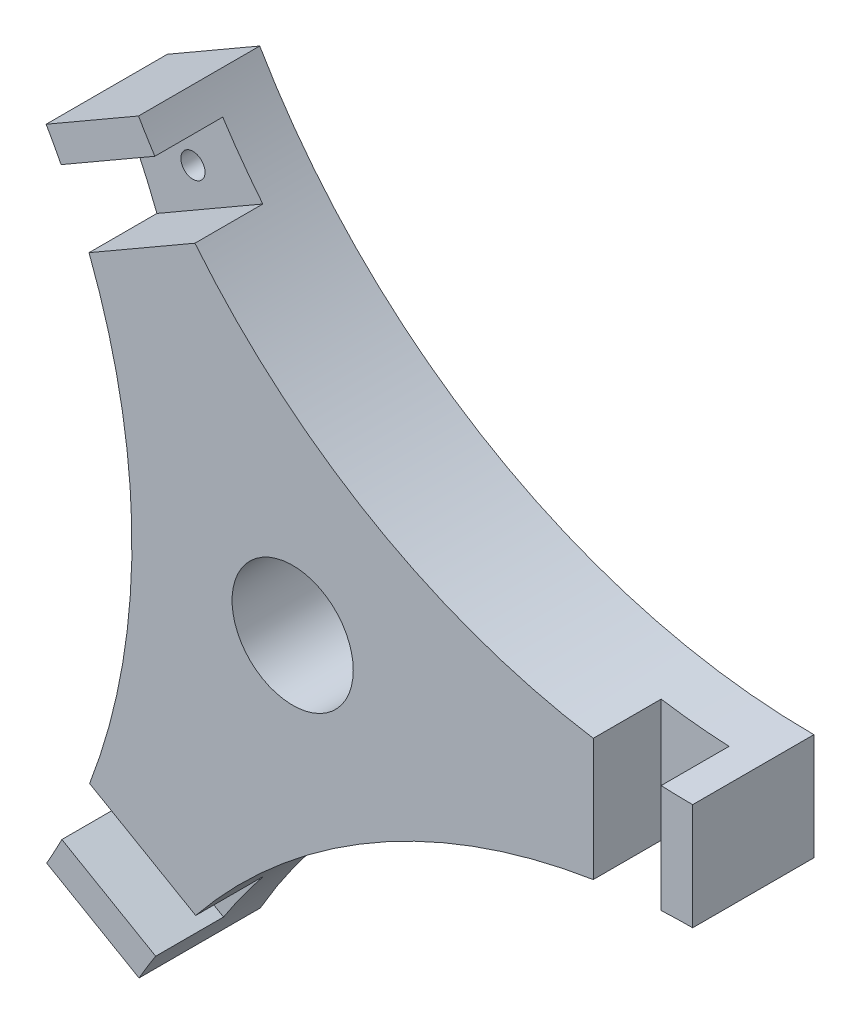
ISO-10303-21;
HEADER;
FILE_DESCRIPTION(('STEP AP214'),'2;1');
FILE_NAME('part.step','',(''),(''),'','','');
FILE_SCHEMA(('AUTOMOTIVE_DESIGN { 1 0 10303 214 1 1 1 1 }'));
ENDSEC;
DATA;
#1=APPLICATION_CONTEXT('core data for automotive mechanical design processes');
#2=APPLICATION_PROTOCOL_DEFINITION('international standard','automotive_design',2000,#1);
#3=PRODUCT_CONTEXT('',#1,'mechanical');
#4=PRODUCT('Part','Part','',(#3));
#5=PRODUCT_RELATED_PRODUCT_CATEGORY('part','',(#4));
#6=PRODUCT_DEFINITION_FORMATION('','',#4);
#7=PRODUCT_DEFINITION_CONTEXT('part definition',#1,'design');
#8=PRODUCT_DEFINITION('design','',#6,#7);
#9=PRODUCT_DEFINITION_SHAPE('','',#8);
#10=(LENGTH_UNIT() NAMED_UNIT(*) SI_UNIT(.MILLI.,.METRE.));
#11=(NAMED_UNIT(*) PLANE_ANGLE_UNIT() SI_UNIT($,.RADIAN.));
#12=(NAMED_UNIT(*) SI_UNIT($,.STERADIAN.) SOLID_ANGLE_UNIT());
#13=UNCERTAINTY_MEASURE_WITH_UNIT(LENGTH_MEASURE(1.E-05),#10,'distance_accuracy_value','');
#14=(GEOMETRIC_REPRESENTATION_CONTEXT(3) GLOBAL_UNCERTAINTY_ASSIGNED_CONTEXT((#13)) GLOBAL_UNIT_ASSIGNED_CONTEXT((#10,
#11,#12)) REPRESENTATION_CONTEXT('',''));
#15=CARTESIAN_POINT('',(0.,0.,0.));
#16=DIRECTION('',(0.,0.,1.));
#17=DIRECTION('',(1.,0.,0.));
#18=AXIS2_PLACEMENT_3D('',#15,#16,#17);
#19=CARTESIAN_POINT('',(41.3639178470361,-71.5532630666437,12.5));
#20=DIRECTION('',(0.,0.,-1.));
#21=DIRECTION('',(-1.,0.,0.));
#22=AXIS2_PLACEMENT_3D('',#19,#20,#21);
#23=PLANE('',#22);
#24=CARTESIAN_POINT('',(0.,0.,12.5));
#25=DIRECTION('',(0.,0.,1.));
#26=DIRECTION('',(1.,0.,0.));
#27=AXIS2_PLACEMENT_3D('',#24,#25,#26);
#28=CIRCLE('',#27,6.25);
#29=CARTESIAN_POINT('',(6.25,0.,12.5));
#30=VERTEX_POINT('',#29);
#31=EDGE_CURVE('E197',#30,#30,#28,.T.);
#32=ORIENTED_EDGE('',*,*,#31,.F.);
#33=EDGE_LOOP('',(#32));
#34=FACE_BOUND('',#33,.T.);
#35=CARTESIAN_POINT('',(41.2500000105281,71.5533612999907,12.5));
#36=DIRECTION('',(0.,0.,-1.));
#37=DIRECTION('',(-1.,0.,0.));
#38=AXIS2_PLACEMENT_3D('',#35,#36,#37);
#39=CIRCLE('',#38,66.0533612999907);
#40=CARTESIAN_POINT('',(31.,6.30013119747944,12.5));
#41=VERTEX_POINT('',#40);
#42=CARTESIAN_POINT('',(-10.0773638707568,29.9775479462477,12.5));
#43=VERTEX_POINT('',#42);
#44=EDGE_CURVE('E175',#41,#43,#39,.T.);
#45=ORIENTED_EDGE('',*,*,#44,.T.);
#46=DIRECTION('',(0.866025403784438,0.500000000000001,0.));
#47=VECTOR('',#46,1.);
#48=CARTESIAN_POINT('',(-23.1397094323187,22.4359992200321,12.5));
#49=LINE('',#48,#47);
#50=CARTESIAN_POINT('',(-20.9990284321859,23.6719219717079,12.5));
#51=VERTEX_POINT('',#50);
#52=EDGE_CURVE('E161',#51,#43,#49,.T.);
#53=ORIENTED_EDGE('',*,*,#52,.F.);
#54=CARTESIAN_POINT('',(-82.6270132225604,-0.0986066236865605,12.5));
#55=DIRECTION('',(0.,0.,-1.));
#56=DIRECTION('',(-1.,0.,0.));
#57=AXIS2_PLACEMENT_3D('',#54,#55,#56);
#58=CIRCLE('',#57,66.0533612999907);
#59=CARTESIAN_POINT('',(-20.9370138922014,-23.7077260830694,12.5));
#60=VERTEX_POINT('',#59);
#61=EDGE_CURVE('E171',#51,#60,#58,.T.);
#62=ORIENTED_EDGE('',*,*,#61,.T.);
#63=DIRECTION('',(-0.866025403784439,0.5,0.));
#64=VECTOR('',#63,1.);
#65=CARTESIAN_POINT('',(-7.86029056767802,-31.2575758146012,12.5));
#66=LINE('',#65,#64);
#67=CARTESIAN_POINT('',(-9.99977731913849,-30.0223425627179,12.5));
#68=VERTEX_POINT('',#67);
#69=EDGE_CURVE('E426',#68,#60,#66,.T.);
#70=ORIENTED_EDGE('',*,*,#69,.F.);
#71=CARTESIAN_POINT('',(41.3639178470361,-71.5532630666437,12.5));
#72=DIRECTION('',(0.,0.,-1.));
#73=DIRECTION('',(-1.,0.,0.));
#74=AXIS2_PLACEMENT_3D('',#71,#72,#73);
#75=CIRCLE('',#74,66.0533612999907);
#76=CARTESIAN_POINT('',(31.,-6.31802913675734,12.5));
#77=VERTEX_POINT('',#76);
#78=EDGE_CURVE('E287',#68,#77,#75,.T.);
#79=ORIENTED_EDGE('',*,*,#78,.T.);
#80=DIRECTION('',(0.,-1.,0.));
#81=VECTOR('',#80,1.);
#82=CARTESIAN_POINT('',(31.,8.82157659455742,12.5));
#83=LINE('',#82,#81);
#84=EDGE_CURVE('E313',#41,#77,#83,.T.);
#85=ORIENTED_EDGE('',*,*,#84,.F.);
#86=EDGE_LOOP('',(#45,#53,#62,#70,#79,#85));
#87=FACE_BOUND('',#86,.T.);
#88=ADVANCED_FACE('F35',(#34,#87),#23,.F.);
#89=CARTESIAN_POINT('',(-17.2849846053381,29.8324025416462,12.5));
#90=DIRECTION('',(0.,0.,-1.));
#91=DIRECTION('',(-1.,0.,0.));
#92=AXIS2_PLACEMENT_3D('',#89,#90,#91);
#93=CYLINDRICAL_SURFACE('',#92,1.25000000000023);
#94=CARTESIAN_POINT('',(-17.2849846053381,29.8324025416462,0.));
#95=DIRECTION('',(0.,0.,1.));
#96=DIRECTION('',(1.,0.,0.));
#97=AXIS2_PLACEMENT_3D('',#94,#95,#96);
#98=CIRCLE('',#97,1.25000000000023);
#99=CARTESIAN_POINT('',(-16.0349846053379,29.8324025416462,0.));
#100=VERTEX_POINT('',#99);
#101=EDGE_CURVE('E329',#100,#100,#98,.T.);
#102=ORIENTED_EDGE('',*,*,#101,.F.);
#103=EDGE_LOOP('',(#102));
#104=FACE_BOUND('',#103,.T.);
#105=CARTESIAN_POINT('',(-17.2849846053381,29.8324025416462,5.5));
#106=DIRECTION('',(0.,0.,1.));
#107=DIRECTION('',(1.,0.,0.));
#108=AXIS2_PLACEMENT_3D('',#105,#106,#107);
#109=CIRCLE('',#108,1.25000000000023);
#110=CARTESIAN_POINT('',(-16.0349846053379,29.8324025416462,5.5));
#111=VERTEX_POINT('',#110);
#112=EDGE_CURVE('E245',#111,#111,#109,.T.);
#113=ORIENTED_EDGE('',*,*,#112,.T.);
#114=EDGE_LOOP('',(#113));
#115=FACE_BOUND('',#114,.T.);
#116=ADVANCED_FACE('F359',(#104,#115),#93,.F.);
#117=CARTESIAN_POINT('',(-25.4231243261525,32.9280740171912,12.5));
#118=VERTEX_POINT('',#117);
#119=CARTESIAN_POINT('',(-23.8774226609054,30.0929840575776,12.5));
#120=VERTEX_POINT('',#119);
#121=EDGE_CURVE('E182',#118,#120,#58,.T.);
#122=ORIENTED_EDGE('',*,*,#121,.T.);
#123=DIRECTION('',(-0.866025403784438,-0.5,0.));
#124=VECTOR('',#123,1.);
#125=CARTESIAN_POINT('',(-26.6397094323187,28.4981770465231,12.5));
#126=LINE('',#125,#124);
#127=CARTESIAN_POINT('',(-14.2096082791269,35.6746992933727,12.5));
#128=VERTEX_POINT('',#127);
#129=EDGE_CURVE('E176',#128,#120,#126,.T.);
#130=ORIENTED_EDGE('',*,*,#129,.F.);
#131=CARTESIAN_POINT('',(-15.8968448845237,38.4280740171912,12.5));
#132=VERTEX_POINT('',#131);
#133=EDGE_CURVE('E257',#128,#132,#39,.T.);
#134=ORIENTED_EDGE('',*,*,#133,.T.);
#135=DIRECTION('',(-0.866025403784438,-0.500000000000001,0.));
#136=VECTOR('',#135,1.);
#137=CARTESIAN_POINT('',(-15.8968448845237,38.4280740171912,12.5));
#138=LINE('',#137,#136);
#139=EDGE_CURVE('E187',#132,#118,#138,.T.);
#140=ORIENTED_EDGE('',*,*,#139,.T.);
#141=EDGE_LOOP('',(#122,#130,#134,#140));
#142=FACE_BOUND('',#141,.T.);
#143=ADVANCED_FACE('F253',(#142),#23,.F.);
#144=CARTESIAN_POINT('',(-17.2281107596581,-29.9309109319857,12.5));
#145=DIRECTION('',(0.,0.,-1.));
#146=DIRECTION('',(-1.,0.,0.));
#147=AXIS2_PLACEMENT_3D('',#144,#145,#146);
#148=CYLINDRICAL_SURFACE('',#147,1.25);
#149=CARTESIAN_POINT('',(-17.2281107596581,-29.9309109319857,0.));
#150=DIRECTION('',(0.,0.,1.));
#151=DIRECTION('',(1.,0.,0.));
#152=AXIS2_PLACEMENT_3D('',#149,#150,#151);
#153=CIRCLE('',#152,1.25);
#154=CARTESIAN_POINT('',(-15.9781107596581,-29.9309109319857,0.));
#155=VERTEX_POINT('',#154);
#156=EDGE_CURVE('E332',#155,#155,#153,.T.);
#157=ORIENTED_EDGE('',*,*,#156,.F.);
#158=EDGE_LOOP('',(#157));
#159=FACE_BOUND('',#158,.T.);
#160=CARTESIAN_POINT('',(-17.2281107596581,-29.9309109319857,5.5));
#161=DIRECTION('',(0.,0.,1.));
#162=DIRECTION('',(1.,0.,0.));
#163=AXIS2_PLACEMENT_3D('',#160,#161,#162);
#164=CIRCLE('',#163,1.25);
#165=CARTESIAN_POINT('',(-15.9781107596581,-29.9309109319857,5.5));
#166=VERTEX_POINT('',#165);
#167=EDGE_CURVE('E237',#166,#166,#164,.T.);
#168=ORIENTED_EDGE('',*,*,#167,.T.);
#169=EDGE_LOOP('',(#168));
#170=FACE_BOUND('',#169,.T.);
#171=ADVANCED_FACE('F369',(#159,#170),#148,.F.);
#172=CARTESIAN_POINT('',(-15.8399710388437,-38.5265824075307,12.5));
#173=VERTEX_POINT('',#172);
#174=CARTESIAN_POINT('',(-14.1266937457081,-35.7225700215696,12.5));
#175=VERTEX_POINT('',#174);
#176=EDGE_CURVE('E281',#173,#175,#75,.T.);
#177=ORIENTED_EDGE('',*,*,#176,.T.);
#178=DIRECTION('',(0.866025403784439,-0.5,0.));
#179=VECTOR('',#178,1.);
#180=CARTESIAN_POINT('',(-11.360290567678,-37.3197536410923,12.5));
#181=LINE('',#180,#179);
#182=CARTESIAN_POINT('',(-23.7994559463766,-30.1379981612064,12.5));
#183=VERTEX_POINT('',#182);
#184=EDGE_CURVE('E431',#183,#175,#181,.T.);
#185=ORIENTED_EDGE('',*,*,#184,.F.);
#186=CARTESIAN_POINT('',(-25.3662504804725,-33.0265824075307,12.5));
#187=VERTEX_POINT('',#186);
#188=EDGE_CURVE('E183',#183,#187,#58,.T.);
#189=ORIENTED_EDGE('',*,*,#188,.T.);
#190=DIRECTION('',(0.866025403784439,-0.5,0.));
#191=VECTOR('',#190,1.);
#192=CARTESIAN_POINT('',(-25.3662504804725,-33.0265824075307,12.5));
#193=LINE('',#192,#191);
#194=EDGE_CURVE('E186',#187,#173,#193,.T.);
#195=ORIENTED_EDGE('',*,*,#194,.T.);
#196=EDGE_LOOP('',(#177,#185,#189,#195));
#197=FACE_BOUND('',#196,.T.);
#198=ADVANCED_FACE('F370',(#197),#23,.F.);
#199=CARTESIAN_POINT('',(34.5,0.,12.5));
#200=DIRECTION('',(0.,0.,-1.));
#201=DIRECTION('',(-1.,0.,0.));
#202=AXIS2_PLACEMENT_3D('',#199,#200,#201);
#203=CYLINDRICAL_SURFACE('',#202,1.25);
#204=CARTESIAN_POINT('',(34.5,0.,0.));
#205=DIRECTION('',(0.,0.,1.));
#206=DIRECTION('',(1.,0.,0.));
#207=AXIS2_PLACEMENT_3D('',#204,#205,#206);
#208=CIRCLE('',#207,1.25);
#209=CARTESIAN_POINT('',(35.75,0.,0.));
#210=VERTEX_POINT('',#209);
#211=EDGE_CURVE('E335',#210,#210,#208,.T.);
#212=ORIENTED_EDGE('',*,*,#211,.F.);
#213=EDGE_LOOP('',(#212));
#214=FACE_BOUND('',#213,.T.);
#215=CARTESIAN_POINT('',(34.5,0.,5.5));
#216=DIRECTION('',(0.,0.,1.));
#217=DIRECTION('',(1.,0.,0.));
#218=AXIS2_PLACEMENT_3D('',#215,#216,#217);
#219=CIRCLE('',#218,1.25);
#220=CARTESIAN_POINT('',(35.75,0.,5.5));
#221=VERTEX_POINT('',#220);
#222=EDGE_CURVE('E226',#221,#221,#219,.T.);
#223=ORIENTED_EDGE('',*,*,#222,.T.);
#224=EDGE_LOOP('',(#223));
#225=FACE_BOUND('',#224,.T.);
#226=ADVANCED_FACE('F372',(#214,#225),#203,.F.);
#227=CARTESIAN_POINT('',(41.25,5.5,12.5));
#228=VERTEX_POINT('',#227);
#229=CARTESIAN_POINT('',(38.,5.58000274550542,12.5));
#230=VERTEX_POINT('',#229);
#231=EDGE_CURVE('E260',#228,#230,#39,.T.);
#232=ORIENTED_EDGE('',*,*,#231,.T.);
#233=DIRECTION('',(0.,1.,0.));
#234=VECTOR('',#233,1.);
#235=CARTESIAN_POINT('',(38.,8.82157659455742,12.5));
#236=LINE('',#235,#234);
#237=CARTESIAN_POINT('',(38.,-5.58561496740113,12.5));
#238=VERTEX_POINT('',#237);
#239=EDGE_CURVE('E298',#238,#230,#236,.T.);
#240=ORIENTED_EDGE('',*,*,#239,.F.);
#241=CARTESIAN_POINT('',(41.25,-5.5,12.5));
#242=VERTEX_POINT('',#241);
#243=EDGE_CURVE('E207',#238,#242,#75,.T.);
#244=ORIENTED_EDGE('',*,*,#243,.T.);
#245=DIRECTION('',(0.,1.,0.));
#246=VECTOR('',#245,1.);
#247=CARTESIAN_POINT('',(41.25,-5.5,12.5));
#248=LINE('',#247,#246);
#249=EDGE_CURVE('E286',#242,#228,#248,.T.);
#250=ORIENTED_EDGE('',*,*,#249,.T.);
#251=EDGE_LOOP('',(#232,#240,#244,#250));
#252=FACE_BOUND('',#251,.T.);
#253=ADVANCED_FACE('F296',(#252),#23,.F.);
#254=CARTESIAN_POINT('',(41.3639178470361,-71.5532630666437,0.));
#255=DIRECTION('',(0.,0.,-1.));
#256=DIRECTION('',(-1.,0.,0.));
#257=AXIS2_PLACEMENT_3D('',#254,#255,#256);
#258=PLANE('',#257);
#259=ORIENTED_EDGE('',*,*,#156,.T.);
#260=EDGE_LOOP('',(#259));
#261=FACE_BOUND('',#260,.T.);
#262=CARTESIAN_POINT('',(0.,0.,0.));
#263=DIRECTION('',(0.,0.,1.));
#264=DIRECTION('',(1.,0.,0.));
#265=AXIS2_PLACEMENT_3D('',#262,#263,#264);
#266=CIRCLE('',#265,6.25);
#267=CARTESIAN_POINT('',(6.25,0.,0.));
#268=VERTEX_POINT('',#267);
#269=EDGE_CURVE('E338',#268,#268,#266,.T.);
#270=ORIENTED_EDGE('',*,*,#269,.T.);
#271=EDGE_LOOP('',(#270));
#272=FACE_BOUND('',#271,.T.);
#273=CARTESIAN_POINT('',(41.3639178470361,-71.5532630666437,0.));
#274=DIRECTION('',(0.,0.,-1.));
#275=DIRECTION('',(-1.,0.,0.));
#276=AXIS2_PLACEMENT_3D('',#273,#274,#275);
#277=CIRCLE('',#276,66.0533612999907);
#278=CARTESIAN_POINT('',(-15.8399710388437,-38.5265824075307,0.));
#279=VERTEX_POINT('',#278);
#280=CARTESIAN_POINT('',(41.25,-5.5,0.));
#281=VERTEX_POINT('',#280);
#282=EDGE_CURVE('E193',#279,#281,#277,.T.);
#283=ORIENTED_EDGE('',*,*,#282,.F.);
#284=DIRECTION('',(0.866025403784439,-0.5,0.));
#285=VECTOR('',#284,1.);
#286=CARTESIAN_POINT('',(-25.3662504804725,-33.0265824075307,0.));
#287=LINE('',#286,#285);
#288=CARTESIAN_POINT('',(-25.3662504804725,-33.0265824075307,0.));
#289=VERTEX_POINT('',#288);
#290=EDGE_CURVE('E205',#289,#279,#287,.T.);
#291=ORIENTED_EDGE('',*,*,#290,.F.);
#292=CARTESIAN_POINT('',(-82.6270132225604,-0.0986066236865605,0.));
#293=DIRECTION('',(0.,0.,-1.));
#294=DIRECTION('',(-1.,0.,0.));
#295=AXIS2_PLACEMENT_3D('',#292,#293,#294);
#296=CIRCLE('',#295,66.0533612999907);
#297=CARTESIAN_POINT('',(-25.4231243261525,32.9280740171912,0.));
#298=VERTEX_POINT('',#297);
#299=EDGE_CURVE('E203',#298,#289,#296,.T.);
#300=ORIENTED_EDGE('',*,*,#299,.F.);
#301=DIRECTION('',(-0.866025403784438,-0.500000000000001,0.));
#302=VECTOR('',#301,1.);
#303=CARTESIAN_POINT('',(-15.8968448845237,38.4280740171912,0.));
#304=LINE('',#303,#302);
#305=CARTESIAN_POINT('',(-15.8968448845237,38.4280740171912,0.));
#306=VERTEX_POINT('',#305);
#307=EDGE_CURVE('E201',#306,#298,#304,.T.);
#308=ORIENTED_EDGE('',*,*,#307,.F.);
#309=CARTESIAN_POINT('',(41.2500000105281,71.5533612999907,0.));
#310=DIRECTION('',(0.,0.,-1.));
#311=DIRECTION('',(-1.,0.,0.));
#312=AXIS2_PLACEMENT_3D('',#309,#310,#311);
#313=CIRCLE('',#312,66.0533612999907);
#314=CARTESIAN_POINT('',(41.25,5.5,0.));
#315=VERTEX_POINT('',#314);
#316=EDGE_CURVE('E199',#315,#306,#313,.T.);
#317=ORIENTED_EDGE('',*,*,#316,.F.);
#318=DIRECTION('',(0.,1.,0.));
#319=VECTOR('',#318,1.);
#320=CARTESIAN_POINT('',(41.25,-5.5,0.));
#321=LINE('',#320,#319);
#322=EDGE_CURVE('E196',#281,#315,#321,.T.);
#323=ORIENTED_EDGE('',*,*,#322,.F.);
#324=EDGE_LOOP('',(#283,#291,#300,#308,#317,#323));
#325=FACE_BOUND('',#324,.T.);
#326=ORIENTED_EDGE('',*,*,#211,.T.);
#327=EDGE_LOOP('',(#326));
#328=FACE_BOUND('',#327,.T.);
#329=ORIENTED_EDGE('',*,*,#101,.T.);
#330=EDGE_LOOP('',(#329));
#331=FACE_BOUND('',#330,.T.);
#332=ADVANCED_FACE('F268',(#261,#272,#325,#328,#331),#258,.T.);
#333=CARTESIAN_POINT('',(41.3639178470361,-71.5532630666437,12.5));
#334=DIRECTION('',(0.,0.,-1.));
#335=DIRECTION('',(-1.,0.,0.));
#336=AXIS2_PLACEMENT_3D('',#333,#334,#335);
#337=CYLINDRICAL_SURFACE('',#336,66.0533612999907);
#338=ORIENTED_EDGE('',*,*,#78,.F.);
#339=DIRECTION('',(0.,0.,-1.));
#340=VECTOR('',#339,1.);
#341=CARTESIAN_POINT('',(-9.99977731913849,-30.0223425627179,12.5));
#342=LINE('',#341,#340);
#343=CARTESIAN_POINT('',(-9.99977731913849,-30.0223425627179,5.5));
#344=VERTEX_POINT('',#343);
#345=EDGE_CURVE('E318',#68,#344,#342,.T.);
#346=ORIENTED_EDGE('',*,*,#345,.T.);
#347=CARTESIAN_POINT('',(41.3639178470361,-71.5532630666437,5.5));
#348=DIRECTION('',(0.,0.,1.));
#349=DIRECTION('',(1.,0.,0.));
#350=AXIS2_PLACEMENT_3D('',#347,#348,#349);
#351=CIRCLE('',#350,66.0533612999907);
#352=CARTESIAN_POINT('',(-14.1266937457081,-35.7225700215696,5.5));
#353=VERTEX_POINT('',#352);
#354=EDGE_CURVE('E437',#353,#344,#351,.F.);
#355=ORIENTED_EDGE('',*,*,#354,.F.);
#356=DIRECTION('',(0.,0.,-1.));
#357=VECTOR('',#356,1.);
#358=CARTESIAN_POINT('',(-14.1266937457081,-35.7225700215696,12.5));
#359=LINE('',#358,#357);
#360=EDGE_CURVE('E283',#353,#175,#359,.F.);
#361=ORIENTED_EDGE('',*,*,#360,.T.);
#362=ORIENTED_EDGE('',*,*,#176,.F.);
#363=DIRECTION('',(0.,0.,-1.));
#364=VECTOR('',#363,1.);
#365=CARTESIAN_POINT('',(-15.8399710388437,-38.5265824075307,12.5));
#366=LINE('',#365,#364);
#367=EDGE_CURVE('E192',#173,#279,#366,.T.);
#368=ORIENTED_EDGE('',*,*,#367,.T.);
#369=ORIENTED_EDGE('',*,*,#282,.T.);
#370=DIRECTION('',(0.,0.,-1.));
#371=VECTOR('',#370,1.);
#372=CARTESIAN_POINT('',(41.25,-5.5,12.5));
#373=LINE('',#372,#371);
#374=EDGE_CURVE('E222',#242,#281,#373,.T.);
#375=ORIENTED_EDGE('',*,*,#374,.F.);
#376=ORIENTED_EDGE('',*,*,#243,.F.);
#377=DIRECTION('',(0.,0.,-1.));
#378=VECTOR('',#377,1.);
#379=CARTESIAN_POINT('',(38.,-5.58561496740113,12.5));
#380=LINE('',#379,#378);
#381=CARTESIAN_POINT('',(38.,-5.58561496740113,5.5));
#382=VERTEX_POINT('',#381);
#383=EDGE_CURVE('E311',#238,#382,#380,.T.);
#384=ORIENTED_EDGE('',*,*,#383,.T.);
#385=CARTESIAN_POINT('',(41.3639178470361,-71.5532630666437,5.5));
#386=DIRECTION('',(0.,0.,1.));
#387=DIRECTION('',(1.,0.,0.));
#388=AXIS2_PLACEMENT_3D('',#385,#386,#387);
#389=CIRCLE('',#388,66.0533612999907);
#390=CARTESIAN_POINT('',(31.,-6.31802913675734,5.5));
#391=VERTEX_POINT('',#390);
#392=EDGE_CURVE('E323',#391,#382,#389,.F.);
#393=ORIENTED_EDGE('',*,*,#392,.F.);
#394=DIRECTION('',(0.,0.,-1.));
#395=VECTOR('',#394,1.);
#396=CARTESIAN_POINT('',(31.,-6.31802913675734,12.5));
#397=LINE('',#396,#395);
#398=EDGE_CURVE('E326',#391,#77,#397,.F.);
#399=ORIENTED_EDGE('',*,*,#398,.T.);
#400=EDGE_LOOP('',(#338,#346,#355,#361,#362,#368,#369,#375,#376,#384,#393,#399));
#401=FACE_BOUND('',#400,.T.);
#402=ADVANCED_FACE('F37',(#401),#337,.F.);
#403=CARTESIAN_POINT('',(41.25,-5.5,12.5));
#404=DIRECTION('',(-1.,0.,0.));
#405=DIRECTION('',(0.,0.,1.));
#406=AXIS2_PLACEMENT_3D('',#403,#404,#405);
#407=PLANE('',#406);
#408=ORIENTED_EDGE('',*,*,#322,.T.);
#409=DIRECTION('',(0.,0.,-1.));
#410=VECTOR('',#409,1.);
#411=CARTESIAN_POINT('',(41.25,5.5,12.5));
#412=LINE('',#411,#410);
#413=EDGE_CURVE('E219',#228,#315,#412,.T.);
#414=ORIENTED_EDGE('',*,*,#413,.F.);
#415=ORIENTED_EDGE('',*,*,#249,.F.);
#416=ORIENTED_EDGE('',*,*,#374,.T.);
#417=EDGE_LOOP('',(#408,#414,#415,#416));
#418=FACE_BOUND('',#417,.T.);
#419=ADVANCED_FACE('F301',(#418),#407,.F.);
#420=CARTESIAN_POINT('',(41.2500000105281,71.5533612999907,12.5));
#421=DIRECTION('',(0.,0.,-1.));
#422=DIRECTION('',(-1.,0.,0.));
#423=AXIS2_PLACEMENT_3D('',#420,#421,#422);
#424=CYLINDRICAL_SURFACE('',#423,66.0533612999907);
#425=CARTESIAN_POINT('',(41.2500000105281,71.5533612999907,5.5));
#426=DIRECTION('',(0.,0.,1.));
#427=DIRECTION('',(1.,0.,0.));
#428=AXIS2_PLACEMENT_3D('',#425,#426,#427);
#429=CIRCLE('',#428,66.0533612999907);
#430=CARTESIAN_POINT('',(-10.0773638707568,29.9775479462477,5.5));
#431=VERTEX_POINT('',#430);
#432=CARTESIAN_POINT('',(-14.2096082791269,35.6746992933727,5.5));
#433=VERTEX_POINT('',#432);
#434=EDGE_CURVE('E419',#431,#433,#429,.F.);
#435=ORIENTED_EDGE('',*,*,#434,.F.);
#436=DIRECTION('',(0.,0.,-1.));
#437=VECTOR('',#436,1.);
#438=CARTESIAN_POINT('',(-10.0773638707568,29.9775479462477,12.5));
#439=LINE('',#438,#437);
#440=EDGE_CURVE('E424',#431,#43,#439,.F.);
#441=ORIENTED_EDGE('',*,*,#440,.T.);
#442=ORIENTED_EDGE('',*,*,#44,.F.);
#443=DIRECTION('',(0.,0.,-1.));
#444=VECTOR('',#443,1.);
#445=CARTESIAN_POINT('',(31.,6.30013119747944,12.5));
#446=LINE('',#445,#444);
#447=CARTESIAN_POINT('',(31.,6.30013119747944,5.5));
#448=VERTEX_POINT('',#447);
#449=EDGE_CURVE('E233',#41,#448,#446,.T.);
#450=ORIENTED_EDGE('',*,*,#449,.T.);
#451=CARTESIAN_POINT('',(41.2500000105281,71.5533612999907,5.5));
#452=DIRECTION('',(0.,0.,1.));
#453=DIRECTION('',(1.,0.,0.));
#454=AXIS2_PLACEMENT_3D('',#451,#452,#453);
#455=CIRCLE('',#454,66.0533612999907);
#456=CARTESIAN_POINT('',(38.,5.58000274550542,5.5));
#457=VERTEX_POINT('',#456);
#458=EDGE_CURVE('E229',#457,#448,#455,.F.);
#459=ORIENTED_EDGE('',*,*,#458,.F.);
#460=DIRECTION('',(0.,0.,-1.));
#461=VECTOR('',#460,1.);
#462=CARTESIAN_POINT('',(38.,5.58000274550542,12.5));
#463=LINE('',#462,#461);
#464=EDGE_CURVE('E225',#457,#230,#463,.F.);
#465=ORIENTED_EDGE('',*,*,#464,.T.);
#466=ORIENTED_EDGE('',*,*,#231,.F.);
#467=ORIENTED_EDGE('',*,*,#413,.T.);
#468=ORIENTED_EDGE('',*,*,#316,.T.);
#469=DIRECTION('',(0.,0.,-1.));
#470=VECTOR('',#469,1.);
#471=CARTESIAN_POINT('',(-15.8968448845237,38.4280740171912,12.5));
#472=LINE('',#471,#470);
#473=EDGE_CURVE('E216',#132,#306,#472,.T.);
#474=ORIENTED_EDGE('',*,*,#473,.F.);
#475=ORIENTED_EDGE('',*,*,#133,.F.);
#476=DIRECTION('',(0.,0.,-1.));
#477=VECTOR('',#476,1.);
#478=CARTESIAN_POINT('',(-14.2096082791269,35.6746992933727,12.5));
#479=LINE('',#478,#477);
#480=EDGE_CURVE('E421',#128,#433,#479,.T.);
#481=ORIENTED_EDGE('',*,*,#480,.T.);
#482=EDGE_LOOP('',(#435,#441,#442,#450,#459,#465,#466,#467,#468,#474,#475,#481));
#483=FACE_BOUND('',#482,.T.);
#484=ADVANCED_FACE('F305',(#483),#424,.F.);
#485=CARTESIAN_POINT('',(-15.8968448845237,38.4280740171912,12.5));
#486=DIRECTION('',(0.5,-0.866025403784438,0.));
#487=DIRECTION('',(0.866025403784438,0.5,0.));
#488=AXIS2_PLACEMENT_3D('',#485,#486,#487);
#489=PLANE('',#488);
#490=ORIENTED_EDGE('',*,*,#307,.T.);
#491=DIRECTION('',(0.,0.,-1.));
#492=VECTOR('',#491,1.);
#493=CARTESIAN_POINT('',(-25.4231243261525,32.9280740171912,12.5));
#494=LINE('',#493,#492);
#495=EDGE_CURVE('E213',#118,#298,#494,.T.);
#496=ORIENTED_EDGE('',*,*,#495,.F.);
#497=ORIENTED_EDGE('',*,*,#139,.F.);
#498=ORIENTED_EDGE('',*,*,#473,.T.);
#499=EDGE_LOOP('',(#490,#496,#497,#498));
#500=FACE_BOUND('',#499,.T.);
#501=ADVANCED_FACE('F261',(#500),#489,.F.);
#502=CARTESIAN_POINT('',(-82.6270132225604,-0.0986066236865605,12.5));
#503=DIRECTION('',(0.,0.,-1.));
#504=DIRECTION('',(-1.,0.,0.));
#505=AXIS2_PLACEMENT_3D('',#502,#503,#504);
#506=CYLINDRICAL_SURFACE('',#505,66.0533612999907);
#507=ORIENTED_EDGE('',*,*,#61,.F.);
#508=DIRECTION('',(0.,0.,-1.));
#509=VECTOR('',#508,1.);
#510=CARTESIAN_POINT('',(-20.9990284321859,23.6719219717079,12.5));
#511=LINE('',#510,#509);
#512=CARTESIAN_POINT('',(-20.9990284321859,23.6719219717079,5.5));
#513=VERTEX_POINT('',#512);
#514=EDGE_CURVE('E11',#51,#513,#511,.T.);
#515=ORIENTED_EDGE('',*,*,#514,.T.);
#516=CARTESIAN_POINT('',(-82.6270132225604,-0.0986066236865605,5.5));
#517=DIRECTION('',(0.,0.,1.));
#518=DIRECTION('',(1.,0.,0.));
#519=AXIS2_PLACEMENT_3D('',#516,#517,#518);
#520=CIRCLE('',#519,66.0533612999907);
#521=CARTESIAN_POINT('',(-23.8774226609054,30.0929840575776,5.5));
#522=VERTEX_POINT('',#521);
#523=EDGE_CURVE('E247',#522,#513,#520,.F.);
#524=ORIENTED_EDGE('',*,*,#523,.F.);
#525=DIRECTION('',(0.,0.,-1.));
#526=VECTOR('',#525,1.);
#527=CARTESIAN_POINT('',(-23.8774226609054,30.0929840575776,12.5));
#528=LINE('',#527,#526);
#529=EDGE_CURVE('E43',#522,#120,#528,.F.);
#530=ORIENTED_EDGE('',*,*,#529,.T.);
#531=ORIENTED_EDGE('',*,*,#121,.F.);
#532=ORIENTED_EDGE('',*,*,#495,.T.);
#533=ORIENTED_EDGE('',*,*,#299,.T.);
#534=DIRECTION('',(0.,0.,-1.));
#535=VECTOR('',#534,1.);
#536=CARTESIAN_POINT('',(-25.3662504804725,-33.0265824075307,12.5));
#537=LINE('',#536,#535);
#538=EDGE_CURVE('E210',#187,#289,#537,.T.);
#539=ORIENTED_EDGE('',*,*,#538,.F.);
#540=ORIENTED_EDGE('',*,*,#188,.F.);
#541=DIRECTION('',(0.,0.,-1.));
#542=VECTOR('',#541,1.);
#543=CARTESIAN_POINT('',(-23.7994559463766,-30.1379981612064,12.5));
#544=LINE('',#543,#542);
#545=CARTESIAN_POINT('',(-23.7994559463766,-30.1379981612064,5.5));
#546=VERTEX_POINT('',#545);
#547=EDGE_CURVE('E236',#183,#546,#544,.T.);
#548=ORIENTED_EDGE('',*,*,#547,.T.);
#549=CARTESIAN_POINT('',(-82.6270132225604,-0.0986066236865605,5.5));
#550=DIRECTION('',(0.,0.,1.));
#551=DIRECTION('',(1.,0.,0.));
#552=AXIS2_PLACEMENT_3D('',#549,#550,#551);
#553=CIRCLE('',#552,66.0533612999907);
#554=CARTESIAN_POINT('',(-20.9370138922014,-23.7077260830694,5.5));
#555=VERTEX_POINT('',#554);
#556=EDGE_CURVE('E240',#555,#546,#553,.F.);
#557=ORIENTED_EDGE('',*,*,#556,.F.);
#558=DIRECTION('',(0.,0.,-1.));
#559=VECTOR('',#558,1.);
#560=CARTESIAN_POINT('',(-20.9370138922014,-23.7077260830694,12.5));
#561=LINE('',#560,#559);
#562=EDGE_CURVE('E181',#555,#60,#561,.F.);
#563=ORIENTED_EDGE('',*,*,#562,.T.);
#564=EDGE_LOOP('',(#507,#515,#524,#530,#531,#532,#533,#539,#540,#548,#557,#563));
#565=FACE_BOUND('',#564,.T.);
#566=ADVANCED_FACE('F179',(#565),#506,.F.);
#567=CARTESIAN_POINT('',(-25.3662504804725,-33.0265824075307,12.5));
#568=DIRECTION('',(0.5,0.866025403784439,0.));
#569=DIRECTION('',(-0.866025403784439,0.5,0.));
#570=AXIS2_PLACEMENT_3D('',#567,#568,#569);
#571=PLANE('',#570);
#572=ORIENTED_EDGE('',*,*,#290,.T.);
#573=ORIENTED_EDGE('',*,*,#367,.F.);
#574=ORIENTED_EDGE('',*,*,#194,.F.);
#575=ORIENTED_EDGE('',*,*,#538,.T.);
#576=EDGE_LOOP('',(#572,#573,#574,#575));
#577=FACE_BOUND('',#576,.T.);
#578=ADVANCED_FACE('F273',(#577),#571,.F.);
#579=CARTESIAN_POINT('',(0.,0.,12.5));
#580=DIRECTION('',(0.,0.,-1.));
#581=DIRECTION('',(-1.,0.,0.));
#582=AXIS2_PLACEMENT_3D('',#579,#580,#581);
#583=CYLINDRICAL_SURFACE('',#582,6.25);
#584=ORIENTED_EDGE('',*,*,#31,.T.);
#585=EDGE_LOOP('',(#584));
#586=FACE_BOUND('',#585,.T.);
#587=ORIENTED_EDGE('',*,*,#269,.F.);
#588=EDGE_LOOP('',(#587));
#589=FACE_BOUND('',#588,.T.);
#590=ADVANCED_FACE('F344',(#586,#589),#583,.F.);
#591=CARTESIAN_POINT('',(31.,8.82157659455742,5.5));
#592=DIRECTION('',(-1.,0.,0.));
#593=DIRECTION('',(0.,0.,1.));
#594=AXIS2_PLACEMENT_3D('',#591,#592,#593);
#595=PLANE('',#594);
#596=DIRECTION('',(0.,-1.,0.));
#597=VECTOR('',#596,1.);
#598=CARTESIAN_POINT('',(31.,8.82157659455742,5.5));
#599=LINE('',#598,#597);
#600=EDGE_CURVE('E312',#448,#391,#599,.T.);
#601=ORIENTED_EDGE('',*,*,#600,.F.);
#602=ORIENTED_EDGE('',*,*,#449,.F.);
#603=ORIENTED_EDGE('',*,*,#84,.T.);
#604=ORIENTED_EDGE('',*,*,#398,.F.);
#605=EDGE_LOOP('',(#601,#602,#603,#604));
#606=FACE_BOUND('',#605,.T.);
#607=ADVANCED_FACE('F346',(#606),#595,.F.);
#608=CARTESIAN_POINT('',(38.,8.82157659455742,5.5));
#609=DIRECTION('',(1.,0.,0.));
#610=DIRECTION('',(0.,0.,-1.));
#611=AXIS2_PLACEMENT_3D('',#608,#609,#610);
#612=PLANE('',#611);
#613=ORIENTED_EDGE('',*,*,#239,.T.);
#614=ORIENTED_EDGE('',*,*,#464,.F.);
#615=DIRECTION('',(0.,1.,0.));
#616=VECTOR('',#615,1.);
#617=CARTESIAN_POINT('',(38.,8.82157659455742,5.5));
#618=LINE('',#617,#616);
#619=EDGE_CURVE('E230',#382,#457,#618,.T.);
#620=ORIENTED_EDGE('',*,*,#619,.F.);
#621=ORIENTED_EDGE('',*,*,#383,.F.);
#622=EDGE_LOOP('',(#613,#614,#620,#621));
#623=FACE_BOUND('',#622,.T.);
#624=ADVANCED_FACE('F310',(#623),#612,.F.);
#625=CARTESIAN_POINT('',(0.,0.,5.5));
#626=DIRECTION('',(0.,0.,1.));
#627=DIRECTION('',(1.,0.,0.));
#628=AXIS2_PLACEMENT_3D('',#625,#626,#627);
#629=PLANE('',#628);
#630=ORIENTED_EDGE('',*,*,#222,.F.);
#631=EDGE_LOOP('',(#630));
#632=FACE_BOUND('',#631,.T.);
#633=ORIENTED_EDGE('',*,*,#392,.T.);
#634=ORIENTED_EDGE('',*,*,#619,.T.);
#635=ORIENTED_EDGE('',*,*,#458,.T.);
#636=ORIENTED_EDGE('',*,*,#600,.T.);
#637=EDGE_LOOP('',(#633,#634,#635,#636));
#638=FACE_BOUND('',#637,.T.);
#639=ADVANCED_FACE('F392',(#632,#638),#629,.T.);
#640=CARTESIAN_POINT('',(-7.86029056767802,-31.2575758146012,5.5));
#641=DIRECTION('',(0.5,0.866025403784439,0.));
#642=DIRECTION('',(-0.866025403784439,0.5,0.));
#643=AXIS2_PLACEMENT_3D('',#640,#641,#642);
#644=PLANE('',#643);
#645=ORIENTED_EDGE('',*,*,#69,.T.);
#646=ORIENTED_EDGE('',*,*,#562,.F.);
#647=DIRECTION('',(-0.866025403784439,0.5,0.));
#648=VECTOR('',#647,1.);
#649=CARTESIAN_POINT('',(-7.86029056767802,-31.2575758146012,5.5));
#650=LINE('',#649,#648);
#651=EDGE_CURVE('E58',#344,#555,#650,.T.);
#652=ORIENTED_EDGE('',*,*,#651,.F.);
#653=ORIENTED_EDGE('',*,*,#345,.F.);
#654=EDGE_LOOP('',(#645,#646,#652,#653));
#655=FACE_BOUND('',#654,.T.);
#656=ADVANCED_FACE('F395',(#655),#644,.F.);
#657=CARTESIAN_POINT('',(-11.360290567678,-37.3197536410923,5.5));
#658=DIRECTION('',(-0.5,-0.866025403784439,0.));
#659=DIRECTION('',(0.866025403784439,-0.5,0.));
#660=AXIS2_PLACEMENT_3D('',#657,#658,#659);
#661=PLANE('',#660);
#662=DIRECTION('',(0.866025403784439,-0.5,0.));
#663=VECTOR('',#662,1.);
#664=CARTESIAN_POINT('',(-11.360290567678,-37.3197536410923,5.5));
#665=LINE('',#664,#663);
#666=EDGE_CURVE('E241',#546,#353,#665,.T.);
#667=ORIENTED_EDGE('',*,*,#666,.F.);
#668=ORIENTED_EDGE('',*,*,#547,.F.);
#669=ORIENTED_EDGE('',*,*,#184,.T.);
#670=ORIENTED_EDGE('',*,*,#360,.F.);
#671=EDGE_LOOP('',(#667,#668,#669,#670));
#672=FACE_BOUND('',#671,.T.);
#673=ADVANCED_FACE('F399',(#672),#661,.F.);
#674=CARTESIAN_POINT('',(0.,0.,5.5));
#675=DIRECTION('',(0.,0.,1.));
#676=DIRECTION('',(1.,0.,0.));
#677=AXIS2_PLACEMENT_3D('',#674,#675,#676);
#678=PLANE('',#677);
#679=ORIENTED_EDGE('',*,*,#167,.F.);
#680=EDGE_LOOP('',(#679));
#681=FACE_BOUND('',#680,.T.);
#682=ORIENTED_EDGE('',*,*,#354,.T.);
#683=ORIENTED_EDGE('',*,*,#651,.T.);
#684=ORIENTED_EDGE('',*,*,#556,.T.);
#685=ORIENTED_EDGE('',*,*,#666,.T.);
#686=EDGE_LOOP('',(#682,#683,#684,#685));
#687=FACE_BOUND('',#686,.T.);
#688=ADVANCED_FACE('F403',(#681,#687),#678,.T.);
#689=CARTESIAN_POINT('',(-23.1397094323187,22.4359992200321,5.5));
#690=DIRECTION('',(0.500000000000001,-0.866025403784438,0.));
#691=DIRECTION('',(0.866025403784438,0.500000000000001,0.));
#692=AXIS2_PLACEMENT_3D('',#689,#690,#691);
#693=PLANE('',#692);
#694=DIRECTION('',(0.866025403784438,0.500000000000001,0.));
#695=VECTOR('',#694,1.);
#696=CARTESIAN_POINT('',(-23.1397094323187,22.4359992200321,5.5));
#697=LINE('',#696,#695);
#698=EDGE_CURVE('E164',#513,#431,#697,.T.);
#699=ORIENTED_EDGE('',*,*,#698,.F.);
#700=ORIENTED_EDGE('',*,*,#514,.F.);
#701=ORIENTED_EDGE('',*,*,#52,.T.);
#702=ORIENTED_EDGE('',*,*,#440,.F.);
#703=EDGE_LOOP('',(#699,#700,#701,#702));
#704=FACE_BOUND('',#703,.T.);
#705=ADVANCED_FACE('F160',(#704),#693,.F.);
#706=CARTESIAN_POINT('',(-26.6397094323187,28.4981770465231,5.5));
#707=DIRECTION('',(-0.5,0.866025403784438,0.));
#708=DIRECTION('',(-0.866025403784439,-0.5,0.));
#709=AXIS2_PLACEMENT_3D('',#706,#707,#708);
#710=PLANE('',#709);
#711=ORIENTED_EDGE('',*,*,#129,.T.);
#712=ORIENTED_EDGE('',*,*,#529,.F.);
#713=DIRECTION('',(-0.866025403784438,-0.5,0.));
#714=VECTOR('',#713,1.);
#715=CARTESIAN_POINT('',(-26.6397094323187,28.4981770465231,5.5));
#716=LINE('',#715,#714);
#717=EDGE_CURVE('E50',#433,#522,#716,.T.);
#718=ORIENTED_EDGE('',*,*,#717,.F.);
#719=ORIENTED_EDGE('',*,*,#480,.F.);
#720=EDGE_LOOP('',(#711,#712,#718,#719));
#721=FACE_BOUND('',#720,.T.);
#722=ADVANCED_FACE('F410',(#721),#710,.F.);
#723=CARTESIAN_POINT('',(0.,0.,5.5));
#724=DIRECTION('',(0.,0.,1.));
#725=DIRECTION('',(1.,0.,0.));
#726=AXIS2_PLACEMENT_3D('',#723,#724,#725);
#727=PLANE('',#726);
#728=ORIENTED_EDGE('',*,*,#112,.F.);
#729=EDGE_LOOP('',(#728));
#730=FACE_BOUND('',#729,.T.);
#731=ORIENTED_EDGE('',*,*,#434,.T.);
#732=ORIENTED_EDGE('',*,*,#717,.T.);
#733=ORIENTED_EDGE('',*,*,#523,.T.);
#734=ORIENTED_EDGE('',*,*,#698,.T.);
#735=EDGE_LOOP('',(#731,#732,#733,#734));
#736=FACE_BOUND('',#735,.T.);
#737=ADVANCED_FACE('F413',(#730,#736),#727,.T.);
#738=CLOSED_SHELL('',(#88,#116,#143,#171,#198,#226,#253,#332,#402,#419,#484,#501,#566,#578,#590,
#607,#624,#639,#656,#673,#688,#705,#722,#737));
#739=MANIFOLD_SOLID_BREP('B2',#738);
#740=ADVANCED_BREP_SHAPE_REPRESENTATION('',(#18,#739),#14);
#741=SHAPE_DEFINITION_REPRESENTATION(#9,#740);
ENDSEC;
END-ISO-10303-21;
